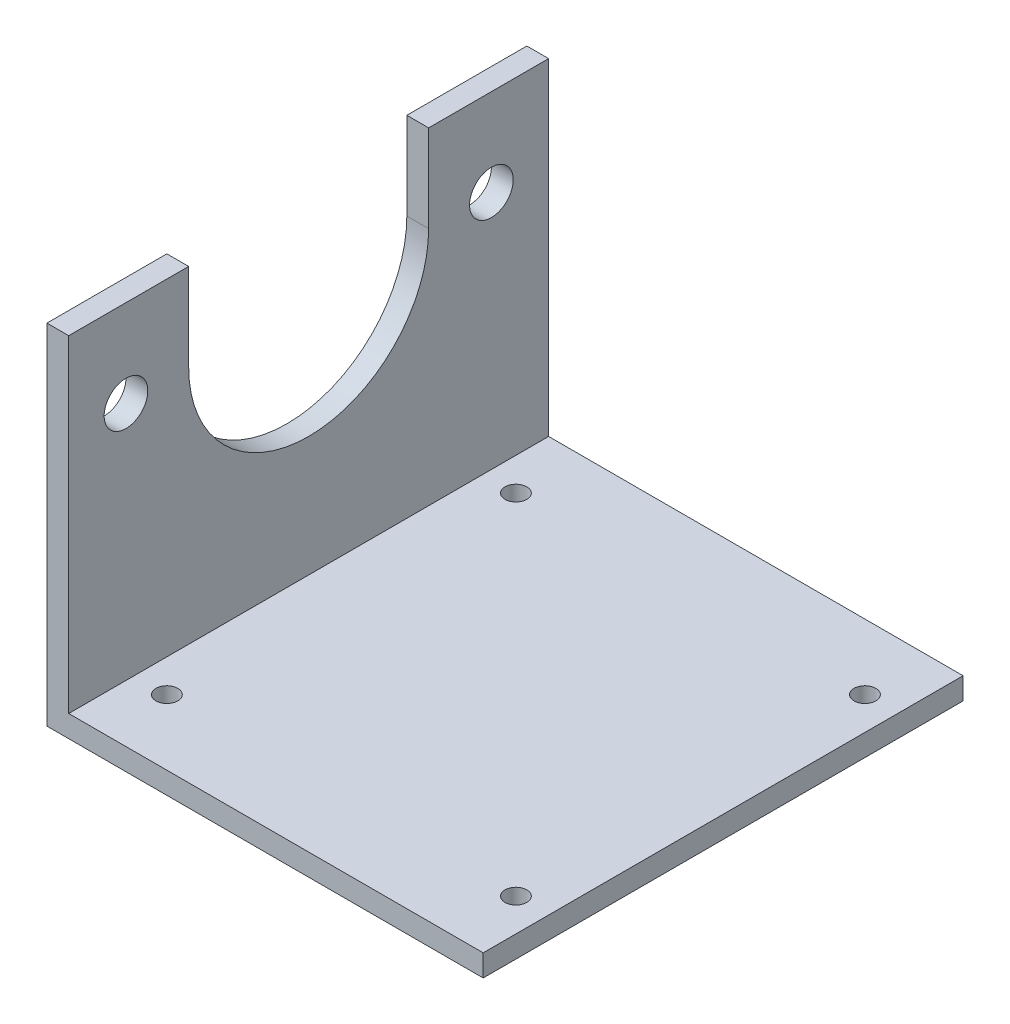
ISO-10303-21;
HEADER;
FILE_DESCRIPTION(('STEP AP214'),'2;1');
FILE_NAME('part.step','',(''),(''),'','','');
FILE_SCHEMA(('AUTOMOTIVE_DESIGN { 1 0 10303 214 1 1 1 1 }'));
ENDSEC;
DATA;
#1=APPLICATION_CONTEXT('core data for automotive mechanical design processes');
#2=APPLICATION_PROTOCOL_DEFINITION('international standard','automotive_design',2000,#1);
#3=PRODUCT_CONTEXT('',#1,'mechanical');
#4=PRODUCT('Part','Part','',(#3));
#5=PRODUCT_RELATED_PRODUCT_CATEGORY('part','',(#4));
#6=PRODUCT_DEFINITION_FORMATION('','',#4);
#7=PRODUCT_DEFINITION_CONTEXT('part definition',#1,'design');
#8=PRODUCT_DEFINITION('design','',#6,#7);
#9=PRODUCT_DEFINITION_SHAPE('','',#8);
#10=(LENGTH_UNIT() NAMED_UNIT(*) SI_UNIT(.MILLI.,.METRE.));
#11=(NAMED_UNIT(*) PLANE_ANGLE_UNIT() SI_UNIT($,.RADIAN.));
#12=(NAMED_UNIT(*) SI_UNIT($,.STERADIAN.) SOLID_ANGLE_UNIT());
#13=UNCERTAINTY_MEASURE_WITH_UNIT(LENGTH_MEASURE(1.E-05),#10,'distance_accuracy_value','');
#14=(GEOMETRIC_REPRESENTATION_CONTEXT(3) GLOBAL_UNCERTAINTY_ASSIGNED_CONTEXT((#13)) GLOBAL_UNIT_ASSIGNED_CONTEXT((#10,
#11,#12)) REPRESENTATION_CONTEXT('',''));
#15=CARTESIAN_POINT('',(0.,0.,0.));
#16=DIRECTION('',(0.,0.,1.));
#17=DIRECTION('',(1.,0.,0.));
#18=AXIS2_PLACEMENT_3D('',#15,#16,#17);
#19=CARTESIAN_POINT('',(0.,95.25,69.85));
#20=DIRECTION('',(0.,-1.,0.));
#21=DIRECTION('',(0.,0.,-1.));
#22=AXIS2_PLACEMENT_3D('',#19,#20,#21);
#23=PLANE('',#22);
#24=DIRECTION('',(0.,0.,-1.));
#25=VECTOR('',#24,1.);
#26=CARTESIAN_POINT('',(0.,95.25,69.85));
#27=LINE('',#26,#25);
#28=CARTESIAN_POINT('',(0.,95.25,69.85));
#29=VERTEX_POINT('',#28);
#30=CARTESIAN_POINT('',(0.,95.25,34.925));
#31=VERTEX_POINT('',#30);
#32=EDGE_CURVE('E44',#29,#31,#27,.T.);
#33=ORIENTED_EDGE('',*,*,#32,.T.);
#34=DIRECTION('',(1.,0.,0.));
#35=VECTOR('',#34,1.);
#36=CARTESIAN_POINT('',(-6.351,95.25,34.925));
#37=LINE('',#36,#35);
#38=CARTESIAN_POINT('',(-6.35,95.25,34.925));
#39=VERTEX_POINT('',#38);
#40=EDGE_CURVE('E181',#39,#31,#37,.T.);
#41=ORIENTED_EDGE('',*,*,#40,.F.);
#42=DIRECTION('',(0.,0.,-1.));
#43=VECTOR('',#42,1.);
#44=CARTESIAN_POINT('',(-6.35,95.25,69.85));
#45=LINE('',#44,#43);
#46=CARTESIAN_POINT('',(-6.35,95.25,69.85));
#47=VERTEX_POINT('',#46);
#48=EDGE_CURVE('E149',#47,#39,#45,.T.);
#49=ORIENTED_EDGE('',*,*,#48,.F.);
#50=DIRECTION('',(-1.,0.,0.));
#51=VECTOR('',#50,1.);
#52=CARTESIAN_POINT('',(0.,95.25,69.85));
#53=LINE('',#52,#51);
#54=EDGE_CURVE('E111',#29,#47,#53,.T.);
#55=ORIENTED_EDGE('',*,*,#54,.F.);
#56=EDGE_LOOP('',(#33,#41,#49,#55));
#57=FACE_BOUND('',#56,.T.);
#58=ADVANCED_FACE('F36',(#57),#23,.F.);
#59=CARTESIAN_POINT('',(120.65,0.,69.85));
#60=DIRECTION('',(0.,-1.,0.));
#61=DIRECTION('',(1.,0.,0.));
#62=AXIS2_PLACEMENT_3D('',#59,#60,#61);
#63=PLANE('',#62);
#64=CARTESIAN_POINT('',(111.125,0.,50.8));
#65=DIRECTION('',(0.,1.,0.));
#66=DIRECTION('',(-1.,0.,0.));
#67=AXIS2_PLACEMENT_3D('',#64,#65,#66);
#68=CIRCLE('',#67,3.175);
#69=CARTESIAN_POINT('',(107.95,0.,50.8));
#70=VERTEX_POINT('',#69);
#71=EDGE_CURVE('E232',#70,#70,#68,.T.);
#72=ORIENTED_EDGE('',*,*,#71,.F.);
#73=EDGE_LOOP('',(#72));
#74=FACE_BOUND('',#73,.T.);
#75=CARTESIAN_POINT('',(9.525,0.,50.8));
#76=DIRECTION('',(0.,1.,0.));
#77=DIRECTION('',(-1.,0.,0.));
#78=AXIS2_PLACEMENT_3D('',#75,#76,#77);
#79=CIRCLE('',#78,3.175);
#80=CARTESIAN_POINT('',(6.35,0.,50.8));
#81=VERTEX_POINT('',#80);
#82=EDGE_CURVE('E226',#81,#81,#79,.T.);
#83=ORIENTED_EDGE('',*,*,#82,.F.);
#84=EDGE_LOOP('',(#83));
#85=FACE_BOUND('',#84,.T.);
#86=CARTESIAN_POINT('',(111.125,0.,-50.8));
#87=DIRECTION('',(0.,1.,0.));
#88=DIRECTION('',(-1.,0.,0.));
#89=AXIS2_PLACEMENT_3D('',#86,#87,#88);
#90=CIRCLE('',#89,3.175);
#91=CARTESIAN_POINT('',(107.95,0.,-50.8));
#92=VERTEX_POINT('',#91);
#93=EDGE_CURVE('E220',#92,#92,#90,.T.);
#94=ORIENTED_EDGE('',*,*,#93,.F.);
#95=EDGE_LOOP('',(#94));
#96=FACE_BOUND('',#95,.T.);
#97=CARTESIAN_POINT('',(9.525,0.,-50.8));
#98=DIRECTION('',(0.,1.,0.));
#99=DIRECTION('',(-1.,0.,0.));
#100=AXIS2_PLACEMENT_3D('',#97,#98,#99);
#101=CIRCLE('',#100,3.175);
#102=CARTESIAN_POINT('',(6.35,0.,-50.8));
#103=VERTEX_POINT('',#102);
#104=EDGE_CURVE('E214',#103,#103,#101,.T.);
#105=ORIENTED_EDGE('',*,*,#104,.F.);
#106=EDGE_LOOP('',(#105));
#107=FACE_BOUND('',#106,.T.);
#108=DIRECTION('',(-1.,0.,0.));
#109=VECTOR('',#108,1.);
#110=CARTESIAN_POINT('',(120.65,0.,-69.85));
#111=LINE('',#110,#109);
#112=CARTESIAN_POINT('',(120.65,0.,-69.85));
#113=VERTEX_POINT('',#112);
#114=CARTESIAN_POINT('',(0.,0.,-69.85));
#115=VERTEX_POINT('',#114);
#116=EDGE_CURVE('E132',#113,#115,#111,.T.);
#117=ORIENTED_EDGE('',*,*,#116,.T.);
#118=DIRECTION('',(0.,0.,-1.));
#119=VECTOR('',#118,1.);
#120=CARTESIAN_POINT('',(0.,0.,69.85));
#121=LINE('',#120,#119);
#122=CARTESIAN_POINT('',(0.,0.,69.85));
#123=VERTEX_POINT('',#122);
#124=EDGE_CURVE('E11',#123,#115,#121,.T.);
#125=ORIENTED_EDGE('',*,*,#124,.F.);
#126=DIRECTION('',(-1.,0.,0.));
#127=VECTOR('',#126,1.);
#128=CARTESIAN_POINT('',(120.65,0.,69.85));
#129=LINE('',#128,#127);
#130=CARTESIAN_POINT('',(120.65,0.,69.85));
#131=VERTEX_POINT('',#130);
#132=EDGE_CURVE('E146',#131,#123,#129,.T.);
#133=ORIENTED_EDGE('',*,*,#132,.F.);
#134=DIRECTION('',(0.,0.,-1.));
#135=VECTOR('',#134,1.);
#136=CARTESIAN_POINT('',(120.65,0.,69.85));
#137=LINE('',#136,#135);
#138=EDGE_CURVE('E128',#131,#113,#137,.T.);
#139=ORIENTED_EDGE('',*,*,#138,.T.);
#140=EDGE_LOOP('',(#117,#125,#133,#139));
#141=FACE_BOUND('',#140,.T.);
#142=ADVANCED_FACE('F38',(#74,#85,#96,#107,#141),#63,.F.);
#143=CARTESIAN_POINT('',(0.,0.,69.85));
#144=DIRECTION('',(-1.,0.,0.));
#145=DIRECTION('',(0.,-1.,0.));
#146=AXIS2_PLACEMENT_3D('',#143,#144,#145);
#147=PLANE('',#146);
#148=CARTESIAN_POINT('',(0.,69.85,-53.1876));
#149=DIRECTION('',(1.,0.,0.));
#150=DIRECTION('',(0.,-1.,0.));
#151=AXIS2_PLACEMENT_3D('',#148,#149,#150);
#152=CIRCLE('',#151,6.35);
#153=CARTESIAN_POINT('',(0.,63.5,-53.1876));
#154=VERTEX_POINT('',#153);
#155=EDGE_CURVE('E208',#154,#154,#152,.T.);
#156=ORIENTED_EDGE('',*,*,#155,.F.);
#157=EDGE_LOOP('',(#156));
#158=FACE_BOUND('',#157,.T.);
#159=CARTESIAN_POINT('',(0.,69.85,53.1876));
#160=DIRECTION('',(1.,0.,0.));
#161=DIRECTION('',(0.,1.,0.));
#162=AXIS2_PLACEMENT_3D('',#159,#160,#161);
#163=CIRCLE('',#162,6.35);
#164=CARTESIAN_POINT('',(0.,76.2,53.1876));
#165=VERTEX_POINT('',#164);
#166=EDGE_CURVE('E202',#165,#165,#163,.T.);
#167=ORIENTED_EDGE('',*,*,#166,.F.);
#168=EDGE_LOOP('',(#167));
#169=FACE_BOUND('',#168,.T.);
#170=CARTESIAN_POINT('',(0.,69.85,0.));
#171=DIRECTION('',(1.,0.,0.));
#172=DIRECTION('',(0.,1.,0.));
#173=AXIS2_PLACEMENT_3D('',#170,#171,#172);
#174=CIRCLE('',#173,34.925);
#175=CARTESIAN_POINT('',(0.,69.85,34.925));
#176=VERTEX_POINT('',#175);
#177=CARTESIAN_POINT('',(0.,69.85,-34.925));
#178=VERTEX_POINT('',#177);
#179=EDGE_CURVE('E190',#176,#178,#174,.T.);
#180=ORIENTED_EDGE('',*,*,#179,.F.);
#181=DIRECTION('',(0.,-1.,0.));
#182=VECTOR('',#181,1.);
#183=CARTESIAN_POINT('',(0.,69.85,34.925));
#184=LINE('',#183,#182);
#185=EDGE_CURVE('E179',#31,#176,#184,.T.);
#186=ORIENTED_EDGE('',*,*,#185,.F.);
#187=ORIENTED_EDGE('',*,*,#32,.F.);
#188=DIRECTION('',(0.,1.,0.));
#189=VECTOR('',#188,1.);
#190=CARTESIAN_POINT('',(0.,0.,69.85));
#191=LINE('',#190,#189);
#192=EDGE_CURVE('E95',#123,#29,#191,.T.);
#193=ORIENTED_EDGE('',*,*,#192,.F.);
#194=ORIENTED_EDGE('',*,*,#124,.T.);
#195=DIRECTION('',(0.,1.,0.));
#196=VECTOR('',#195,1.);
#197=CARTESIAN_POINT('',(0.,0.,-69.85));
#198=LINE('',#197,#196);
#199=CARTESIAN_POINT('',(0.,95.25,-69.85));
#200=VERTEX_POINT('',#199);
#201=EDGE_CURVE('E135',#115,#200,#198,.T.);
#202=ORIENTED_EDGE('',*,*,#201,.T.);
#203=CARTESIAN_POINT('',(0.,95.25,-34.925));
#204=VERTEX_POINT('',#203);
#205=EDGE_CURVE('E150',#204,#200,#27,.T.);
#206=ORIENTED_EDGE('',*,*,#205,.F.);
#207=DIRECTION('',(0.,1.,0.));
#208=VECTOR('',#207,1.);
#209=CARTESIAN_POINT('',(0.,95.25,-34.925));
#210=LINE('',#209,#208);
#211=EDGE_CURVE('E188',#178,#204,#210,.T.);
#212=ORIENTED_EDGE('',*,*,#211,.F.);
#213=EDGE_LOOP('',(#180,#186,#187,#193,#194,#202,#206,#212));
#214=FACE_BOUND('',#213,.T.);
#215=ADVANCED_FACE('F163',(#158,#169,#214),#147,.F.);
#216=CARTESIAN_POINT('',(-6.35,95.25,-34.925));
#217=VERTEX_POINT('',#216);
#218=CARTESIAN_POINT('',(-6.35,95.25,-69.85));
#219=VERTEX_POINT('',#218);
#220=EDGE_CURVE('E123',#217,#219,#45,.T.);
#221=ORIENTED_EDGE('',*,*,#220,.F.);
#222=DIRECTION('',(1.,0.,0.));
#223=VECTOR('',#222,1.);
#224=CARTESIAN_POINT('',(-6.351,95.25,-34.925));
#225=LINE('',#224,#223);
#226=EDGE_CURVE('E51',#217,#204,#225,.T.);
#227=ORIENTED_EDGE('',*,*,#226,.T.);
#228=ORIENTED_EDGE('',*,*,#205,.T.);
#229=DIRECTION('',(-1.,0.,0.));
#230=VECTOR('',#229,1.);
#231=CARTESIAN_POINT('',(0.,95.25,-69.85));
#232=LINE('',#231,#230);
#233=EDGE_CURVE('E139',#200,#219,#232,.T.);
#234=ORIENTED_EDGE('',*,*,#233,.T.);
#235=EDGE_LOOP('',(#221,#227,#228,#234));
#236=FACE_BOUND('',#235,.T.);
#237=ADVANCED_FACE('F158',(#236),#23,.F.);
#238=CARTESIAN_POINT('',(-6.35,95.25,69.85));
#239=DIRECTION('',(1.,0.,0.));
#240=DIRECTION('',(0.,1.,0.));
#241=AXIS2_PLACEMENT_3D('',#238,#239,#240);
#242=PLANE('',#241);
#243=CARTESIAN_POINT('',(-6.35,69.85,-53.1876));
#244=DIRECTION('',(1.,0.,0.));
#245=DIRECTION('',(0.,1.,0.));
#246=AXIS2_PLACEMENT_3D('',#243,#244,#245);
#247=CIRCLE('',#246,6.35);
#248=CARTESIAN_POINT('',(-6.35,76.2,-53.1876));
#249=VERTEX_POINT('',#248);
#250=EDGE_CURVE('E205',#249,#249,#247,.F.);
#251=ORIENTED_EDGE('',*,*,#250,.F.);
#252=EDGE_LOOP('',(#251));
#253=FACE_BOUND('',#252,.T.);
#254=CARTESIAN_POINT('',(-6.35,69.85,53.1876));
#255=DIRECTION('',(1.,0.,0.));
#256=DIRECTION('',(0.,1.,0.));
#257=AXIS2_PLACEMENT_3D('',#254,#255,#256);
#258=CIRCLE('',#257,6.35);
#259=CARTESIAN_POINT('',(-6.35,76.2,53.1876));
#260=VERTEX_POINT('',#259);
#261=EDGE_CURVE('E199',#260,#260,#258,.F.);
#262=ORIENTED_EDGE('',*,*,#261,.F.);
#263=EDGE_LOOP('',(#262));
#264=FACE_BOUND('',#263,.T.);
#265=ORIENTED_EDGE('',*,*,#48,.T.);
#266=DIRECTION('',(0.,1.,0.));
#267=VECTOR('',#266,1.);
#268=CARTESIAN_POINT('',(-6.35,69.85,34.925));
#269=LINE('',#268,#267);
#270=CARTESIAN_POINT('',(-6.35,69.85,34.925));
#271=VERTEX_POINT('',#270);
#272=EDGE_CURVE('E193',#271,#39,#269,.T.);
#273=ORIENTED_EDGE('',*,*,#272,.F.);
#274=CARTESIAN_POINT('',(-6.35,69.85,0.));
#275=DIRECTION('',(1.,0.,0.));
#276=DIRECTION('',(0.,1.,0.));
#277=AXIS2_PLACEMENT_3D('',#274,#275,#276);
#278=CIRCLE('',#277,34.925);
#279=CARTESIAN_POINT('',(-6.35,69.85,-34.925));
#280=VERTEX_POINT('',#279);
#281=EDGE_CURVE('E196',#280,#271,#278,.F.);
#282=ORIENTED_EDGE('',*,*,#281,.F.);
#283=DIRECTION('',(0.,-1.,0.));
#284=VECTOR('',#283,1.);
#285=CARTESIAN_POINT('',(-6.35,95.25,-34.925));
#286=LINE('',#285,#284);
#287=EDGE_CURVE('E136',#217,#280,#286,.T.);
#288=ORIENTED_EDGE('',*,*,#287,.F.);
#289=ORIENTED_EDGE('',*,*,#220,.T.);
#290=DIRECTION('',(0.,-1.,0.));
#291=VECTOR('',#290,1.);
#292=CARTESIAN_POINT('',(-6.35,95.25,-69.85));
#293=LINE('',#292,#291);
#294=CARTESIAN_POINT('',(-6.35,-6.35,-69.85));
#295=VERTEX_POINT('',#294);
#296=EDGE_CURVE('E120',#219,#295,#293,.T.);
#297=ORIENTED_EDGE('',*,*,#296,.T.);
#298=DIRECTION('',(0.,0.,-1.));
#299=VECTOR('',#298,1.);
#300=CARTESIAN_POINT('',(-6.35,-6.35,69.85));
#301=LINE('',#300,#299);
#302=CARTESIAN_POINT('',(-6.35,-6.35,69.85));
#303=VERTEX_POINT('',#302);
#304=EDGE_CURVE('E117',#303,#295,#301,.T.);
#305=ORIENTED_EDGE('',*,*,#304,.F.);
#306=DIRECTION('',(0.,-1.,0.));
#307=VECTOR('',#306,1.);
#308=CARTESIAN_POINT('',(-6.35,95.25,69.85));
#309=LINE('',#308,#307);
#310=EDGE_CURVE('E104',#47,#303,#309,.T.);
#311=ORIENTED_EDGE('',*,*,#310,.F.);
#312=EDGE_LOOP('',(#265,#273,#282,#288,#289,#297,#305,#311));
#313=FACE_BOUND('',#312,.T.);
#314=ADVANCED_FACE('F118',(#253,#264,#313),#242,.F.);
#315=CARTESIAN_POINT('',(-6.35,-6.35,69.85));
#316=DIRECTION('',(0.,1.,0.));
#317=DIRECTION('',(-1.,0.,0.));
#318=AXIS2_PLACEMENT_3D('',#315,#316,#317);
#319=PLANE('',#318);
#320=CARTESIAN_POINT('',(111.125,-6.34999999999999,50.8));
#321=DIRECTION('',(0.,1.,0.));
#322=DIRECTION('',(-1.,0.,0.));
#323=AXIS2_PLACEMENT_3D('',#320,#321,#322);
#324=CIRCLE('',#323,3.175);
#325=CARTESIAN_POINT('',(107.95,-6.34999999999999,50.8));
#326=VERTEX_POINT('',#325);
#327=EDGE_CURVE('E229',#326,#326,#324,.F.);
#328=ORIENTED_EDGE('',*,*,#327,.F.);
#329=EDGE_LOOP('',(#328));
#330=FACE_BOUND('',#329,.T.);
#331=CARTESIAN_POINT('',(9.525,-6.35,50.8));
#332=DIRECTION('',(0.,1.,0.));
#333=DIRECTION('',(-1.,0.,0.));
#334=AXIS2_PLACEMENT_3D('',#331,#332,#333);
#335=CIRCLE('',#334,3.175);
#336=CARTESIAN_POINT('',(6.35,-6.35,50.8));
#337=VERTEX_POINT('',#336);
#338=EDGE_CURVE('E223',#337,#337,#335,.F.);
#339=ORIENTED_EDGE('',*,*,#338,.F.);
#340=EDGE_LOOP('',(#339));
#341=FACE_BOUND('',#340,.T.);
#342=CARTESIAN_POINT('',(111.125,-6.34999999999999,-50.8));
#343=DIRECTION('',(0.,1.,0.));
#344=DIRECTION('',(-1.,0.,0.));
#345=AXIS2_PLACEMENT_3D('',#342,#343,#344);
#346=CIRCLE('',#345,3.175);
#347=CARTESIAN_POINT('',(107.95,-6.34999999999999,-50.8));
#348=VERTEX_POINT('',#347);
#349=EDGE_CURVE('E217',#348,#348,#346,.F.);
#350=ORIENTED_EDGE('',*,*,#349,.F.);
#351=EDGE_LOOP('',(#350));
#352=FACE_BOUND('',#351,.T.);
#353=CARTESIAN_POINT('',(9.525,-6.35,-50.8));
#354=DIRECTION('',(0.,1.,0.));
#355=DIRECTION('',(-1.,0.,0.));
#356=AXIS2_PLACEMENT_3D('',#353,#354,#355);
#357=CIRCLE('',#356,3.175);
#358=CARTESIAN_POINT('',(6.35,-6.35,-50.8));
#359=VERTEX_POINT('',#358);
#360=EDGE_CURVE('E211',#359,#359,#357,.F.);
#361=ORIENTED_EDGE('',*,*,#360,.F.);
#362=EDGE_LOOP('',(#361));
#363=FACE_BOUND('',#362,.T.);
#364=DIRECTION('',(1.,0.,0.));
#365=VECTOR('',#364,1.);
#366=CARTESIAN_POINT('',(-6.35,-6.35,-69.85));
#367=LINE('',#366,#365);
#368=CARTESIAN_POINT('',(120.65,-6.34999999999999,-69.85));
#369=VERTEX_POINT('',#368);
#370=EDGE_CURVE('E143',#295,#369,#367,.T.);
#371=ORIENTED_EDGE('',*,*,#370,.T.);
#372=DIRECTION('',(0.,0.,-1.));
#373=VECTOR('',#372,1.);
#374=CARTESIAN_POINT('',(120.65,-6.34999999999999,69.85));
#375=LINE('',#374,#373);
#376=CARTESIAN_POINT('',(120.65,-6.34999999999999,69.85));
#377=VERTEX_POINT('',#376);
#378=EDGE_CURVE('E124',#377,#369,#375,.T.);
#379=ORIENTED_EDGE('',*,*,#378,.F.);
#380=DIRECTION('',(1.,0.,0.));
#381=VECTOR('',#380,1.);
#382=CARTESIAN_POINT('',(-6.35,-6.35,69.85));
#383=LINE('',#382,#381);
#384=EDGE_CURVE('E108',#303,#377,#383,.T.);
#385=ORIENTED_EDGE('',*,*,#384,.F.);
#386=ORIENTED_EDGE('',*,*,#304,.T.);
#387=EDGE_LOOP('',(#371,#379,#385,#386));
#388=FACE_BOUND('',#387,.T.);
#389=ADVANCED_FACE('F126',(#330,#341,#352,#363,#388),#319,.F.);
#390=CARTESIAN_POINT('',(120.65,-6.34999999999999,69.85));
#391=DIRECTION('',(-1.,0.,0.));
#392=DIRECTION('',(0.,0.,1.));
#393=AXIS2_PLACEMENT_3D('',#390,#391,#392);
#394=PLANE('',#393);
#395=DIRECTION('',(0.,1.,0.));
#396=VECTOR('',#395,1.);
#397=CARTESIAN_POINT('',(120.65,-6.34999999999999,-69.85));
#398=LINE('',#397,#396);
#399=EDGE_CURVE('E87',#369,#113,#398,.T.);
#400=ORIENTED_EDGE('',*,*,#399,.T.);
#401=ORIENTED_EDGE('',*,*,#138,.F.);
#402=DIRECTION('',(0.,1.,0.));
#403=VECTOR('',#402,1.);
#404=CARTESIAN_POINT('',(120.65,-6.34999999999999,69.85));
#405=LINE('',#404,#403);
#406=EDGE_CURVE('E60',#377,#131,#405,.T.);
#407=ORIENTED_EDGE('',*,*,#406,.F.);
#408=ORIENTED_EDGE('',*,*,#378,.T.);
#409=EDGE_LOOP('',(#400,#401,#407,#408));
#410=FACE_BOUND('',#409,.T.);
#411=ADVANCED_FACE('F168',(#410),#394,.F.);
#412=CARTESIAN_POINT('',(0.,0.,69.85));
#413=DIRECTION('',(0.,0.,-1.));
#414=DIRECTION('',(-1.,0.,0.));
#415=AXIS2_PLACEMENT_3D('',#412,#413,#414);
#416=PLANE('',#415);
#417=ORIENTED_EDGE('',*,*,#132,.T.);
#418=ORIENTED_EDGE('',*,*,#192,.T.);
#419=ORIENTED_EDGE('',*,*,#54,.T.);
#420=ORIENTED_EDGE('',*,*,#310,.T.);
#421=ORIENTED_EDGE('',*,*,#384,.T.);
#422=ORIENTED_EDGE('',*,*,#406,.T.);
#423=EDGE_LOOP('',(#417,#418,#419,#420,#421,#422));
#424=FACE_BOUND('',#423,.T.);
#425=ADVANCED_FACE('F106',(#424),#416,.F.);
#426=CARTESIAN_POINT('',(0.,0.,-69.85));
#427=DIRECTION('',(0.,0.,-1.));
#428=DIRECTION('',(-1.,0.,0.));
#429=AXIS2_PLACEMENT_3D('',#426,#427,#428);
#430=PLANE('',#429);
#431=ORIENTED_EDGE('',*,*,#116,.F.);
#432=ORIENTED_EDGE('',*,*,#399,.F.);
#433=ORIENTED_EDGE('',*,*,#370,.F.);
#434=ORIENTED_EDGE('',*,*,#296,.F.);
#435=ORIENTED_EDGE('',*,*,#233,.F.);
#436=ORIENTED_EDGE('',*,*,#201,.F.);
#437=EDGE_LOOP('',(#431,#432,#433,#434,#435,#436));
#438=FACE_BOUND('',#437,.T.);
#439=ADVANCED_FACE('F167',(#438),#430,.T.);
#440=CARTESIAN_POINT('',(-6.351,69.85,0.));
#441=DIRECTION('',(1.,0.,0.));
#442=DIRECTION('',(0.,1.,0.));
#443=AXIS2_PLACEMENT_3D('',#440,#441,#442);
#444=CYLINDRICAL_SURFACE('',#443,34.925);
#445=ORIENTED_EDGE('',*,*,#281,.T.);
#446=DIRECTION('',(1.,0.,0.));
#447=VECTOR('',#446,1.);
#448=CARTESIAN_POINT('',(-6.351,69.85,34.925));
#449=LINE('',#448,#447);
#450=EDGE_CURVE('E175',#271,#176,#449,.T.);
#451=ORIENTED_EDGE('',*,*,#450,.T.);
#452=ORIENTED_EDGE('',*,*,#179,.T.);
#453=DIRECTION('',(1.,0.,0.));
#454=VECTOR('',#453,1.);
#455=CARTESIAN_POINT('',(-6.351,69.85,-34.925));
#456=LINE('',#455,#454);
#457=EDGE_CURVE('E176',#280,#178,#456,.T.);
#458=ORIENTED_EDGE('',*,*,#457,.F.);
#459=EDGE_LOOP('',(#445,#451,#452,#458));
#460=FACE_BOUND('',#459,.T.);
#461=ADVANCED_FACE('F299',(#460),#444,.F.);
#462=CARTESIAN_POINT('',(-6.351,69.85,34.925));
#463=DIRECTION('',(0.,0.,1.));
#464=DIRECTION('',(0.,-1.,0.));
#465=AXIS2_PLACEMENT_3D('',#462,#463,#464);
#466=PLANE('',#465);
#467=ORIENTED_EDGE('',*,*,#272,.T.);
#468=ORIENTED_EDGE('',*,*,#40,.T.);
#469=ORIENTED_EDGE('',*,*,#185,.T.);
#470=ORIENTED_EDGE('',*,*,#450,.F.);
#471=EDGE_LOOP('',(#467,#468,#469,#470));
#472=FACE_BOUND('',#471,.T.);
#473=ADVANCED_FACE('F295',(#472),#466,.F.);
#474=CARTESIAN_POINT('',(-6.351,95.25,-34.925));
#475=DIRECTION('',(0.,0.,-1.));
#476=DIRECTION('',(0.,1.,0.));
#477=AXIS2_PLACEMENT_3D('',#474,#475,#476);
#478=PLANE('',#477);
#479=ORIENTED_EDGE('',*,*,#287,.T.);
#480=ORIENTED_EDGE('',*,*,#457,.T.);
#481=ORIENTED_EDGE('',*,*,#211,.T.);
#482=ORIENTED_EDGE('',*,*,#226,.F.);
#483=EDGE_LOOP('',(#479,#480,#481,#482));
#484=FACE_BOUND('',#483,.T.);
#485=ADVANCED_FACE('F285',(#484),#478,.F.);
#486=CARTESIAN_POINT('',(-6.351,69.85,53.1876));
#487=DIRECTION('',(1.,0.,0.));
#488=DIRECTION('',(0.,1.,0.));
#489=AXIS2_PLACEMENT_3D('',#486,#487,#488);
#490=CYLINDRICAL_SURFACE('',#489,6.35);
#491=ORIENTED_EDGE('',*,*,#166,.T.);
#492=EDGE_LOOP('',(#491));
#493=FACE_BOUND('',#492,.T.);
#494=ORIENTED_EDGE('',*,*,#261,.T.);
#495=EDGE_LOOP('',(#494));
#496=FACE_BOUND('',#495,.T.);
#497=ADVANCED_FACE('F282',(#493,#496),#490,.F.);
#498=CARTESIAN_POINT('',(-6.351,69.85,-53.1876));
#499=DIRECTION('',(1.,0.,0.));
#500=DIRECTION('',(0.,1.,0.));
#501=AXIS2_PLACEMENT_3D('',#498,#499,#500);
#502=CYLINDRICAL_SURFACE('',#501,6.35);
#503=ORIENTED_EDGE('',*,*,#155,.T.);
#504=EDGE_LOOP('',(#503));
#505=FACE_BOUND('',#504,.T.);
#506=ORIENTED_EDGE('',*,*,#250,.T.);
#507=EDGE_LOOP('',(#506));
#508=FACE_BOUND('',#507,.T.);
#509=ADVANCED_FACE('F251',(#505,#508),#502,.F.);
#510=CARTESIAN_POINT('',(9.525,-6.35100000000001,-50.8));
#511=DIRECTION('',(0.,1.,0.));
#512=DIRECTION('',(-1.,0.,0.));
#513=AXIS2_PLACEMENT_3D('',#510,#511,#512);
#514=CYLINDRICAL_SURFACE('',#513,3.175);
#515=ORIENTED_EDGE('',*,*,#104,.T.);
#516=EDGE_LOOP('',(#515));
#517=FACE_BOUND('',#516,.T.);
#518=ORIENTED_EDGE('',*,*,#360,.T.);
#519=EDGE_LOOP('',(#518));
#520=FACE_BOUND('',#519,.T.);
#521=ADVANCED_FACE('F247',(#517,#520),#514,.F.);
#522=CARTESIAN_POINT('',(111.125,-6.351,-50.8));
#523=DIRECTION('',(0.,1.,0.));
#524=DIRECTION('',(-1.,0.,0.));
#525=AXIS2_PLACEMENT_3D('',#522,#523,#524);
#526=CYLINDRICAL_SURFACE('',#525,3.175);
#527=ORIENTED_EDGE('',*,*,#93,.T.);
#528=EDGE_LOOP('',(#527));
#529=FACE_BOUND('',#528,.T.);
#530=ORIENTED_EDGE('',*,*,#349,.T.);
#531=EDGE_LOOP('',(#530));
#532=FACE_BOUND('',#531,.T.);
#533=ADVANCED_FACE('F250',(#529,#532),#526,.F.);
#534=CARTESIAN_POINT('',(9.525,-6.35100000000001,50.8));
#535=DIRECTION('',(0.,1.,0.));
#536=DIRECTION('',(-1.,0.,0.));
#537=AXIS2_PLACEMENT_3D('',#534,#535,#536);
#538=CYLINDRICAL_SURFACE('',#537,3.175);
#539=ORIENTED_EDGE('',*,*,#82,.T.);
#540=EDGE_LOOP('',(#539));
#541=FACE_BOUND('',#540,.T.);
#542=ORIENTED_EDGE('',*,*,#338,.T.);
#543=EDGE_LOOP('',(#542));
#544=FACE_BOUND('',#543,.T.);
#545=ADVANCED_FACE('F363',(#541,#544),#538,.F.);
#546=CARTESIAN_POINT('',(111.125,-6.351,50.8));
#547=DIRECTION('',(0.,1.,0.));
#548=DIRECTION('',(-1.,0.,0.));
#549=AXIS2_PLACEMENT_3D('',#546,#547,#548);
#550=CYLINDRICAL_SURFACE('',#549,3.175);
#551=ORIENTED_EDGE('',*,*,#71,.T.);
#552=EDGE_LOOP('',(#551));
#553=FACE_BOUND('',#552,.T.);
#554=ORIENTED_EDGE('',*,*,#327,.T.);
#555=EDGE_LOOP('',(#554));
#556=FACE_BOUND('',#555,.T.);
#557=ADVANCED_FACE('F236',(#553,#556),#550,.F.);
#558=CLOSED_SHELL('',(#58,#142,#215,#237,#314,#389,#411,#425,#439,#461,#473,#485,#497,#509,#521,
#533,#545,#557));
#559=MANIFOLD_SOLID_BREP('B2',#558);
#560=ADVANCED_BREP_SHAPE_REPRESENTATION('',(#18,#559),#14);
#561=SHAPE_DEFINITION_REPRESENTATION(#9,#560);
ENDSEC;
END-ISO-10303-21;
